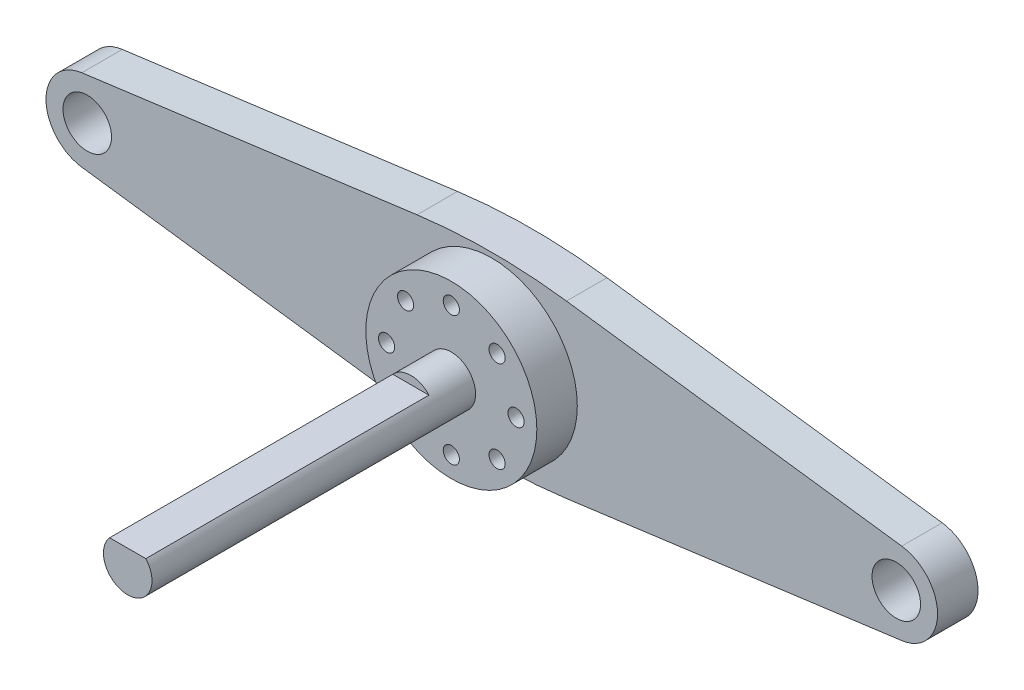
ISO-10303-21;
HEADER;
FILE_DESCRIPTION(('STEP AP214'),'2;1');
FILE_NAME('part.step','',(''),(''),'','','');
FILE_SCHEMA(('AUTOMOTIVE_DESIGN { 1 0 10303 214 1 1 1 1 }'));
ENDSEC;
DATA;
#1=APPLICATION_CONTEXT('core data for automotive mechanical design processes');
#2=APPLICATION_PROTOCOL_DEFINITION('international standard','automotive_design',2000,#1);
#3=PRODUCT_CONTEXT('',#1,'mechanical');
#4=PRODUCT('Part','Part','',(#3));
#5=PRODUCT_RELATED_PRODUCT_CATEGORY('part','',(#4));
#6=PRODUCT_DEFINITION_FORMATION('','',#4);
#7=PRODUCT_DEFINITION_CONTEXT('part definition',#1,'design');
#8=PRODUCT_DEFINITION('design','',#6,#7);
#9=PRODUCT_DEFINITION_SHAPE('','',#8);
#10=(LENGTH_UNIT() NAMED_UNIT(*) SI_UNIT(.MILLI.,.METRE.));
#11=(NAMED_UNIT(*) PLANE_ANGLE_UNIT() SI_UNIT($,.RADIAN.));
#12=(NAMED_UNIT(*) SI_UNIT($,.STERADIAN.) SOLID_ANGLE_UNIT());
#13=UNCERTAINTY_MEASURE_WITH_UNIT(LENGTH_MEASURE(1.E-05),#10,'distance_accuracy_value','');
#14=(GEOMETRIC_REPRESENTATION_CONTEXT(3) GLOBAL_UNCERTAINTY_ASSIGNED_CONTEXT((#13)) GLOBAL_UNIT_ASSIGNED_CONTEXT((#10,
#11,#12)) REPRESENTATION_CONTEXT('',''));
#15=CARTESIAN_POINT('',(0.,0.,0.));
#16=DIRECTION('',(0.,0.,1.));
#17=DIRECTION('',(1.,0.,0.));
#18=AXIS2_PLACEMENT_3D('',#15,#16,#17);
#19=CARTESIAN_POINT('',(-5.65685424949245,-5.65685424949231,5.));
#20=DIRECTION('',(0.,0.,-1.));
#21=DIRECTION('',(-1.,0.,0.));
#22=AXIS2_PLACEMENT_3D('',#19,#20,#21);
#23=CYLINDRICAL_SURFACE('',#22,1.);
#24=CARTESIAN_POINT('',(-5.65685424949245,-5.65685424949231,0.));
#25=DIRECTION('',(0.,0.,1.));
#26=DIRECTION('',(1.,0.,0.));
#27=AXIS2_PLACEMENT_3D('',#24,#25,#26);
#28=CIRCLE('',#27,1.);
#29=CARTESIAN_POINT('',(-4.65685424949245,-5.65685424949231,0.));
#30=VERTEX_POINT('',#29);
#31=EDGE_CURVE('E218',#30,#30,#28,.T.);
#32=ORIENTED_EDGE('',*,*,#31,.F.);
#33=EDGE_LOOP('',(#32));
#34=FACE_BOUND('',#33,.T.);
#35=CARTESIAN_POINT('',(-5.65685424949245,-5.65685424949231,10.));
#36=DIRECTION('',(0.,0.,1.));
#37=DIRECTION('',(1.,0.,0.));
#38=AXIS2_PLACEMENT_3D('',#35,#36,#37);
#39=CIRCLE('',#38,1.);
#40=CARTESIAN_POINT('',(-4.65685424949245,-5.65685424949231,10.));
#41=VERTEX_POINT('',#40);
#42=EDGE_CURVE('E261',#41,#41,#39,.T.);
#43=ORIENTED_EDGE('',*,*,#42,.T.);
#44=EDGE_LOOP('',(#43));
#45=FACE_BOUND('',#44,.T.);
#46=ADVANCED_FACE('F64',(#34,#45),#23,.F.);
#47=CARTESIAN_POINT('',(0.,-8.,5.));
#48=DIRECTION('',(0.,0.,-1.));
#49=DIRECTION('',(-1.,0.,0.));
#50=AXIS2_PLACEMENT_3D('',#47,#48,#49);
#51=CYLINDRICAL_SURFACE('',#50,1.);
#52=CARTESIAN_POINT('',(0.,-8.,0.));
#53=DIRECTION('',(0.,0.,1.));
#54=DIRECTION('',(1.,0.,0.));
#55=AXIS2_PLACEMENT_3D('',#52,#53,#54);
#56=CIRCLE('',#55,1.);
#57=CARTESIAN_POINT('',(0.999999999999915,-8.,0.));
#58=VERTEX_POINT('',#57);
#59=EDGE_CURVE('E215',#58,#58,#56,.T.);
#60=ORIENTED_EDGE('',*,*,#59,.F.);
#61=EDGE_LOOP('',(#60));
#62=FACE_BOUND('',#61,.T.);
#63=CARTESIAN_POINT('',(0.,-8.,10.));
#64=DIRECTION('',(0.,0.,1.));
#65=DIRECTION('',(1.,0.,0.));
#66=AXIS2_PLACEMENT_3D('',#63,#64,#65);
#67=CIRCLE('',#66,1.);
#68=CARTESIAN_POINT('',(0.999999999999915,-8.,10.));
#69=VERTEX_POINT('',#68);
#70=EDGE_CURVE('E264',#69,#69,#67,.T.);
#71=ORIENTED_EDGE('',*,*,#70,.T.);
#72=EDGE_LOOP('',(#71));
#73=FACE_BOUND('',#72,.T.);
#74=ADVANCED_FACE('F325',(#62,#73),#51,.F.);
#75=CARTESIAN_POINT('',(5.65685424949233,-5.65685424949243,5.));
#76=DIRECTION('',(0.,0.,-1.));
#77=DIRECTION('',(-1.,0.,0.));
#78=AXIS2_PLACEMENT_3D('',#75,#76,#77);
#79=CYLINDRICAL_SURFACE('',#78,1.);
#80=CARTESIAN_POINT('',(5.65685424949233,-5.65685424949243,0.));
#81=DIRECTION('',(0.,0.,1.));
#82=DIRECTION('',(1.,0.,0.));
#83=AXIS2_PLACEMENT_3D('',#80,#81,#82);
#84=CIRCLE('',#83,1.);
#85=CARTESIAN_POINT('',(6.65685424949233,-5.65685424949243,0.));
#86=VERTEX_POINT('',#85);
#87=EDGE_CURVE('E212',#86,#86,#84,.T.);
#88=ORIENTED_EDGE('',*,*,#87,.F.);
#89=EDGE_LOOP('',(#88));
#90=FACE_BOUND('',#89,.T.);
#91=CARTESIAN_POINT('',(5.65685424949233,-5.65685424949243,10.));
#92=DIRECTION('',(0.,0.,1.));
#93=DIRECTION('',(1.,0.,0.));
#94=AXIS2_PLACEMENT_3D('',#91,#92,#93);
#95=CIRCLE('',#94,1.);
#96=CARTESIAN_POINT('',(6.65685424949233,-5.65685424949243,10.));
#97=VERTEX_POINT('',#96);
#98=EDGE_CURVE('E267',#97,#97,#95,.T.);
#99=ORIENTED_EDGE('',*,*,#98,.T.);
#100=EDGE_LOOP('',(#99));
#101=FACE_BOUND('',#100,.T.);
#102=ADVANCED_FACE('F331',(#90,#101),#79,.F.);
#103=CARTESIAN_POINT('',(8.,0.,5.));
#104=DIRECTION('',(0.,0.,-1.));
#105=DIRECTION('',(-1.,0.,0.));
#106=AXIS2_PLACEMENT_3D('',#103,#104,#105);
#107=CYLINDRICAL_SURFACE('',#106,0.999999999999999);
#108=CARTESIAN_POINT('',(8.,0.,0.));
#109=DIRECTION('',(0.,0.,1.));
#110=DIRECTION('',(1.,0.,0.));
#111=AXIS2_PLACEMENT_3D('',#108,#109,#110);
#112=CIRCLE('',#111,0.999999999999999);
#113=CARTESIAN_POINT('',(9.,0.,0.));
#114=VERTEX_POINT('',#113);
#115=EDGE_CURVE('E209',#114,#114,#112,.T.);
#116=ORIENTED_EDGE('',*,*,#115,.F.);
#117=EDGE_LOOP('',(#116));
#118=FACE_BOUND('',#117,.T.);
#119=CARTESIAN_POINT('',(8.,0.,10.));
#120=DIRECTION('',(0.,0.,1.));
#121=DIRECTION('',(1.,0.,0.));
#122=AXIS2_PLACEMENT_3D('',#119,#120,#121);
#123=CIRCLE('',#122,0.999999999999999);
#124=CARTESIAN_POINT('',(9.,0.,10.));
#125=VERTEX_POINT('',#124);
#126=EDGE_CURVE('E270',#125,#125,#123,.T.);
#127=ORIENTED_EDGE('',*,*,#126,.T.);
#128=EDGE_LOOP('',(#127));
#129=FACE_BOUND('',#128,.T.);
#130=ADVANCED_FACE('F341',(#118,#129),#107,.F.);
#131=CARTESIAN_POINT('',(5.65685424949241,5.65685424949235,5.));
#132=DIRECTION('',(0.,0.,-1.));
#133=DIRECTION('',(-1.,0.,0.));
#134=AXIS2_PLACEMENT_3D('',#131,#132,#133);
#135=CYLINDRICAL_SURFACE('',#134,0.999999999999999);
#136=CARTESIAN_POINT('',(5.65685424949241,5.65685424949235,0.));
#137=DIRECTION('',(0.,0.,1.));
#138=DIRECTION('',(1.,0.,0.));
#139=AXIS2_PLACEMENT_3D('',#136,#137,#138);
#140=CIRCLE('',#139,0.999999999999999);
#141=CARTESIAN_POINT('',(6.65685424949241,5.65685424949235,0.));
#142=VERTEX_POINT('',#141);
#143=EDGE_CURVE('E206',#142,#142,#140,.T.);
#144=ORIENTED_EDGE('',*,*,#143,.F.);
#145=EDGE_LOOP('',(#144));
#146=FACE_BOUND('',#145,.T.);
#147=CARTESIAN_POINT('',(5.65685424949241,5.65685424949235,10.));
#148=DIRECTION('',(0.,0.,1.));
#149=DIRECTION('',(1.,0.,0.));
#150=AXIS2_PLACEMENT_3D('',#147,#148,#149);
#151=CIRCLE('',#150,0.999999999999999);
#152=CARTESIAN_POINT('',(6.65685424949241,5.65685424949235,10.));
#153=VERTEX_POINT('',#152);
#154=EDGE_CURVE('E273',#153,#153,#151,.T.);
#155=ORIENTED_EDGE('',*,*,#154,.T.);
#156=EDGE_LOOP('',(#155));
#157=FACE_BOUND('',#156,.T.);
#158=ADVANCED_FACE('F345',(#146,#157),#135,.F.);
#159=CARTESIAN_POINT('',(0.,8.,5.));
#160=DIRECTION('',(0.,0.,-1.));
#161=DIRECTION('',(-1.,0.,0.));
#162=AXIS2_PLACEMENT_3D('',#159,#160,#161);
#163=CYLINDRICAL_SURFACE('',#162,1.);
#164=CARTESIAN_POINT('',(0.,8.,0.));
#165=DIRECTION('',(0.,0.,1.));
#166=DIRECTION('',(1.,0.,0.));
#167=AXIS2_PLACEMENT_3D('',#164,#165,#166);
#168=CIRCLE('',#167,1.);
#169=CARTESIAN_POINT('',(1.00000000000003,8.,0.));
#170=VERTEX_POINT('',#169);
#171=EDGE_CURVE('E203',#170,#170,#168,.T.);
#172=ORIENTED_EDGE('',*,*,#171,.F.);
#173=EDGE_LOOP('',(#172));
#174=FACE_BOUND('',#173,.T.);
#175=CARTESIAN_POINT('',(0.,8.,10.));
#176=DIRECTION('',(0.,0.,1.));
#177=DIRECTION('',(1.,0.,0.));
#178=AXIS2_PLACEMENT_3D('',#175,#176,#177);
#179=CIRCLE('',#178,1.);
#180=CARTESIAN_POINT('',(1.00000000000003,8.,10.));
#181=VERTEX_POINT('',#180);
#182=EDGE_CURVE('E276',#181,#181,#179,.T.);
#183=ORIENTED_EDGE('',*,*,#182,.T.);
#184=EDGE_LOOP('',(#183));
#185=FACE_BOUND('',#184,.T.);
#186=ADVANCED_FACE('F349',(#174,#185),#163,.F.);
#187=CARTESIAN_POINT('',(-8.,0.,5.));
#188=DIRECTION('',(0.,0.,-1.));
#189=DIRECTION('',(-1.,0.,0.));
#190=AXIS2_PLACEMENT_3D('',#187,#188,#189);
#191=CYLINDRICAL_SURFACE('',#190,1.);
#192=CARTESIAN_POINT('',(-8.,0.,0.));
#193=DIRECTION('',(0.,0.,1.));
#194=DIRECTION('',(1.,0.,0.));
#195=AXIS2_PLACEMENT_3D('',#192,#193,#194);
#196=CIRCLE('',#195,1.);
#197=CARTESIAN_POINT('',(-7.,0.,0.));
#198=VERTEX_POINT('',#197);
#199=EDGE_CURVE('E200',#198,#198,#196,.T.);
#200=ORIENTED_EDGE('',*,*,#199,.F.);
#201=EDGE_LOOP('',(#200));
#202=FACE_BOUND('',#201,.T.);
#203=CARTESIAN_POINT('',(-8.,0.,10.));
#204=DIRECTION('',(0.,0.,1.));
#205=DIRECTION('',(1.,0.,0.));
#206=AXIS2_PLACEMENT_3D('',#203,#204,#205);
#207=CIRCLE('',#206,1.);
#208=CARTESIAN_POINT('',(-7.,0.,10.));
#209=VERTEX_POINT('',#208);
#210=EDGE_CURVE('E279',#209,#209,#207,.T.);
#211=ORIENTED_EDGE('',*,*,#210,.T.);
#212=EDGE_LOOP('',(#211));
#213=FACE_BOUND('',#212,.T.);
#214=ADVANCED_FACE('F353',(#202,#213),#191,.F.);
#215=CARTESIAN_POINT('',(-5.65685424949237,5.65685424949239,5.));
#216=DIRECTION('',(0.,0.,-1.));
#217=DIRECTION('',(-1.,0.,0.));
#218=AXIS2_PLACEMENT_3D('',#215,#216,#217);
#219=CYLINDRICAL_SURFACE('',#218,0.999999999999999);
#220=CARTESIAN_POINT('',(-5.65685424949237,5.65685424949239,0.));
#221=DIRECTION('',(0.,0.,1.));
#222=DIRECTION('',(1.,0.,0.));
#223=AXIS2_PLACEMENT_3D('',#220,#221,#222);
#224=CIRCLE('',#223,0.999999999999999);
#225=CARTESIAN_POINT('',(-4.65685424949237,5.65685424949239,0.));
#226=VERTEX_POINT('',#225);
#227=EDGE_CURVE('E197',#226,#226,#224,.T.);
#228=ORIENTED_EDGE('',*,*,#227,.F.);
#229=EDGE_LOOP('',(#228));
#230=FACE_BOUND('',#229,.T.);
#231=CARTESIAN_POINT('',(-5.65685424949237,5.65685424949239,10.));
#232=DIRECTION('',(0.,0.,1.));
#233=DIRECTION('',(1.,0.,0.));
#234=AXIS2_PLACEMENT_3D('',#231,#232,#233);
#235=CIRCLE('',#234,0.999999999999999);
#236=CARTESIAN_POINT('',(-4.65685424949237,5.65685424949239,10.));
#237=VERTEX_POINT('',#236);
#238=EDGE_CURVE('E282',#237,#237,#235,.T.);
#239=ORIENTED_EDGE('',*,*,#238,.T.);
#240=EDGE_LOOP('',(#239));
#241=FACE_BOUND('',#240,.T.);
#242=ADVANCED_FACE('F357',(#230,#241),#219,.F.);
#243=CARTESIAN_POINT('',(0.,58.8173671567806,5.));
#244=DIRECTION('',(0.,0.,-1.));
#245=DIRECTION('',(-1.,0.,0.));
#246=AXIS2_PLACEMENT_3D('',#243,#244,#245);
#247=CYLINDRICAL_SURFACE('',#246,70.);
#248=CARTESIAN_POINT('',(0.,58.8173671567806,0.));
#249=DIRECTION('',(0.,0.,1.));
#250=DIRECTION('',(1.,0.,0.));
#251=AXIS2_PLACEMENT_3D('',#248,#249,#250);
#252=CIRCLE('',#251,70.);
#253=CARTESIAN_POINT('',(-9.23511167640649,-10.5707637614413,0.));
#254=VERTEX_POINT('',#253);
#255=CARTESIAN_POINT('',(9.23511167640649,-10.5707637614413,0.));
#256=VERTEX_POINT('',#255);
#257=EDGE_CURVE('E181',#254,#256,#252,.T.);
#258=ORIENTED_EDGE('',*,*,#257,.T.);
#259=DIRECTION('',(0.,0.,-1.));
#260=VECTOR('',#259,1.);
#261=CARTESIAN_POINT('',(9.23511167640649,-10.5707637614413,5.));
#262=LINE('',#261,#260);
#263=CARTESIAN_POINT('',(9.23511167640649,-10.5707637614413,5.));
#264=VERTEX_POINT('',#263);
#265=EDGE_CURVE('E73',#264,#256,#262,.T.);
#266=ORIENTED_EDGE('',*,*,#265,.F.);
#267=CARTESIAN_POINT('',(0.,58.8173671567806,5.));
#268=DIRECTION('',(0.,0.,1.));
#269=DIRECTION('',(1.,0.,0.));
#270=AXIS2_PLACEMENT_3D('',#267,#268,#269);
#271=CIRCLE('',#270,70.);
#272=CARTESIAN_POINT('',(-9.23511167640649,-10.5707637614413,5.));
#273=VERTEX_POINT('',#272);
#274=EDGE_CURVE('E129',#273,#264,#271,.T.);
#275=ORIENTED_EDGE('',*,*,#274,.F.);
#276=DIRECTION('',(0.,0.,-1.));
#277=VECTOR('',#276,1.);
#278=CARTESIAN_POINT('',(-9.23511167640649,-10.5707637614413,5.));
#279=LINE('',#278,#277);
#280=EDGE_CURVE('E12',#273,#254,#279,.T.);
#281=ORIENTED_EDGE('',*,*,#280,.T.);
#282=EDGE_LOOP('',(#258,#266,#275,#281));
#283=FACE_BOUND('',#282,.T.);
#284=ADVANCED_FACE('F235',(#283),#247,.T.);
#285=CARTESIAN_POINT('',(1.54315479575544,-11.5945134987938,5.));
#286=DIRECTION('',(0.131930166805804,-0.991259013117456,0.));
#287=DIRECTION('',(0.991259013117456,0.131930166805804,0.));
#288=AXIS2_PLACEMENT_3D('',#285,#286,#287);
#289=PLANE('',#288);
#290=DIRECTION('',(-0.991259013117456,-0.131930166805804,0.));
#291=VECTOR('',#290,1.);
#292=CARTESIAN_POINT('',(1.54315479575544,-11.5945134987938,0.));
#293=LINE('',#292,#291);
#294=CARTESIAN_POINT('',(50.6728763500851,-5.05566515137672,0.));
#295=VERTEX_POINT('',#294);
#296=EDGE_CURVE('E184',#295,#256,#293,.T.);
#297=ORIENTED_EDGE('',*,*,#296,.F.);
#298=DIRECTION('',(0.,0.,-1.));
#299=VECTOR('',#298,1.);
#300=CARTESIAN_POINT('',(50.6728763500851,-5.05566515137672,5.));
#301=LINE('',#300,#299);
#302=CARTESIAN_POINT('',(50.6728763500851,-5.05566515137672,5.));
#303=VERTEX_POINT('',#302);
#304=EDGE_CURVE('E227',#303,#295,#301,.T.);
#305=ORIENTED_EDGE('',*,*,#304,.F.);
#306=DIRECTION('',(-0.991259013117456,-0.131930166805804,0.));
#307=VECTOR('',#306,1.);
#308=CARTESIAN_POINT('',(1.54315479575544,-11.5945134987938,5.));
#309=LINE('',#308,#307);
#310=EDGE_CURVE('E234',#303,#264,#309,.T.);
#311=ORIENTED_EDGE('',*,*,#310,.T.);
#312=ORIENTED_EDGE('',*,*,#265,.T.);
#313=EDGE_LOOP('',(#297,#305,#311,#312));
#314=FACE_BOUND('',#313,.T.);
#315=ADVANCED_FACE('F232',(#314),#289,.T.);
#316=CARTESIAN_POINT('',(50.,0.,5.));
#317=DIRECTION('',(0.,0.,-1.));
#318=DIRECTION('',(-1.,0.,0.));
#319=AXIS2_PLACEMENT_3D('',#316,#317,#318);
#320=CYLINDRICAL_SURFACE('',#319,5.10024633771241);
#321=CARTESIAN_POINT('',(50.,0.,0.));
#322=DIRECTION('',(0.,0.,1.));
#323=DIRECTION('',(1.,0.,0.));
#324=AXIS2_PLACEMENT_3D('',#321,#322,#323);
#325=CIRCLE('',#324,5.10024633771241);
#326=CARTESIAN_POINT('',(50.6728763500851,5.05566515137672,0.));
#327=VERTEX_POINT('',#326);
#328=EDGE_CURVE('E187',#327,#295,#325,.F.);
#329=ORIENTED_EDGE('',*,*,#328,.F.);
#330=DIRECTION('',(0.,0.,-1.));
#331=VECTOR('',#330,1.);
#332=CARTESIAN_POINT('',(50.6728763500851,5.05566515137672,5.));
#333=LINE('',#332,#331);
#334=CARTESIAN_POINT('',(50.6728763500851,5.05566515137672,5.));
#335=VERTEX_POINT('',#334);
#336=EDGE_CURVE('E225',#335,#327,#333,.T.);
#337=ORIENTED_EDGE('',*,*,#336,.F.);
#338=CARTESIAN_POINT('',(50.,0.,5.));
#339=DIRECTION('',(0.,0.,1.));
#340=DIRECTION('',(1.,0.,0.));
#341=AXIS2_PLACEMENT_3D('',#338,#339,#340);
#342=CIRCLE('',#341,5.10024633771241);
#343=EDGE_CURVE('E246',#335,#303,#342,.F.);
#344=ORIENTED_EDGE('',*,*,#343,.T.);
#345=ORIENTED_EDGE('',*,*,#304,.T.);
#346=EDGE_LOOP('',(#329,#337,#344,#345));
#347=FACE_BOUND('',#346,.T.);
#348=ADVANCED_FACE('F244',(#347),#320,.T.);
#349=CARTESIAN_POINT('',(1.54315479575544,11.5945134987938,5.));
#350=DIRECTION('',(-0.131930166805804,-0.991259013117456,0.));
#351=DIRECTION('',(0.991259013117456,-0.131930166805804,0.));
#352=AXIS2_PLACEMENT_3D('',#349,#350,#351);
#353=PLANE('',#352);
#354=DIRECTION('',(-0.991259013117456,0.131930166805804,0.));
#355=VECTOR('',#354,1.);
#356=CARTESIAN_POINT('',(1.54315479575544,11.5945134987938,0.));
#357=LINE('',#356,#355);
#358=CARTESIAN_POINT('',(9.23511167640649,10.5707637614413,0.));
#359=VERTEX_POINT('',#358);
#360=EDGE_CURVE('E190',#327,#359,#357,.T.);
#361=ORIENTED_EDGE('',*,*,#360,.T.);
#362=DIRECTION('',(0.,0.,-1.));
#363=VECTOR('',#362,1.);
#364=CARTESIAN_POINT('',(9.23511167640649,10.5707637614413,5.));
#365=LINE('',#364,#363);
#366=CARTESIAN_POINT('',(9.23511167640649,10.5707637614413,5.));
#367=VERTEX_POINT('',#366);
#368=EDGE_CURVE('E156',#367,#359,#365,.T.);
#369=ORIENTED_EDGE('',*,*,#368,.F.);
#370=DIRECTION('',(-0.991259013117456,0.131930166805804,0.));
#371=VECTOR('',#370,1.);
#372=CARTESIAN_POINT('',(1.54315479575544,11.5945134987938,5.));
#373=LINE('',#372,#371);
#374=EDGE_CURVE('E163',#335,#367,#373,.T.);
#375=ORIENTED_EDGE('',*,*,#374,.F.);
#376=ORIENTED_EDGE('',*,*,#336,.T.);
#377=EDGE_LOOP('',(#361,#369,#375,#376));
#378=FACE_BOUND('',#377,.T.);
#379=ADVANCED_FACE('F370',(#378),#353,.F.);
#380=CARTESIAN_POINT('',(0.,-58.8173671567806,5.));
#381=DIRECTION('',(0.,0.,-1.));
#382=DIRECTION('',(-1.,0.,0.));
#383=AXIS2_PLACEMENT_3D('',#380,#381,#382);
#384=CYLINDRICAL_SURFACE('',#383,70.);
#385=CARTESIAN_POINT('',(0.,-58.8173671567806,0.));
#386=DIRECTION('',(0.,0.,1.));
#387=DIRECTION('',(1.,0.,0.));
#388=AXIS2_PLACEMENT_3D('',#385,#386,#387);
#389=CIRCLE('',#388,70.);
#390=CARTESIAN_POINT('',(-9.23511167640649,10.5707637614413,0.));
#391=VERTEX_POINT('',#390);
#392=EDGE_CURVE('E151',#391,#359,#389,.F.);
#393=ORIENTED_EDGE('',*,*,#392,.F.);
#394=DIRECTION('',(0.,0.,-1.));
#395=VECTOR('',#394,1.);
#396=CARTESIAN_POINT('',(-9.23511167640649,10.5707637614413,5.));
#397=LINE('',#396,#395);
#398=CARTESIAN_POINT('',(-9.23511167640649,10.5707637614413,5.));
#399=VERTEX_POINT('',#398);
#400=EDGE_CURVE('E146',#399,#391,#397,.T.);
#401=ORIENTED_EDGE('',*,*,#400,.F.);
#402=CARTESIAN_POINT('',(0.,-58.8173671567806,5.));
#403=DIRECTION('',(0.,0.,1.));
#404=DIRECTION('',(1.,0.,0.));
#405=AXIS2_PLACEMENT_3D('',#402,#403,#404);
#406=CIRCLE('',#405,70.);
#407=EDGE_CURVE('E149',#399,#367,#406,.F.);
#408=ORIENTED_EDGE('',*,*,#407,.T.);
#409=ORIENTED_EDGE('',*,*,#368,.T.);
#410=EDGE_LOOP('',(#393,#401,#408,#409));
#411=FACE_BOUND('',#410,.T.);
#412=ADVANCED_FACE('F148',(#411),#384,.T.);
#413=CARTESIAN_POINT('',(-1.54315479575544,11.5945134987938,5.));
#414=DIRECTION('',(-0.131930166805804,0.991259013117456,0.));
#415=DIRECTION('',(-0.991259013117456,-0.131930166805804,0.));
#416=AXIS2_PLACEMENT_3D('',#413,#414,#415);
#417=PLANE('',#416);
#418=DIRECTION('',(0.991259013117456,0.131930166805804,0.));
#419=VECTOR('',#418,1.);
#420=CARTESIAN_POINT('',(-1.54315479575544,11.5945134987938,0.));
#421=LINE('',#420,#419);
#422=CARTESIAN_POINT('',(-50.6728763500851,5.05566515137672,0.));
#423=VERTEX_POINT('',#422);
#424=EDGE_CURVE('E194',#423,#391,#421,.T.);
#425=ORIENTED_EDGE('',*,*,#424,.F.);
#426=DIRECTION('',(0.,0.,-1.));
#427=VECTOR('',#426,1.);
#428=CARTESIAN_POINT('',(-50.6728763500851,5.05566515137672,5.));
#429=LINE('',#428,#427);
#430=CARTESIAN_POINT('',(-50.6728763500851,5.05566515137672,5.));
#431=VERTEX_POINT('',#430);
#432=EDGE_CURVE('E157',#431,#423,#429,.T.);
#433=ORIENTED_EDGE('',*,*,#432,.F.);
#434=DIRECTION('',(0.991259013117456,0.131930166805804,0.));
#435=VECTOR('',#434,1.);
#436=CARTESIAN_POINT('',(-1.54315479575544,11.5945134987938,5.));
#437=LINE('',#436,#435);
#438=EDGE_CURVE('E160',#431,#399,#437,.T.);
#439=ORIENTED_EDGE('',*,*,#438,.T.);
#440=ORIENTED_EDGE('',*,*,#400,.T.);
#441=EDGE_LOOP('',(#425,#433,#439,#440));
#442=FACE_BOUND('',#441,.T.);
#443=ADVANCED_FACE('F166',(#442),#417,.T.);
#444=CARTESIAN_POINT('',(-50.,0.,5.));
#445=DIRECTION('',(0.,0.,-1.));
#446=DIRECTION('',(-1.,0.,0.));
#447=AXIS2_PLACEMENT_3D('',#444,#445,#446);
#448=CYLINDRICAL_SURFACE('',#447,5.10024633771241);
#449=CARTESIAN_POINT('',(-50.,0.,0.));
#450=DIRECTION('',(0.,0.,1.));
#451=DIRECTION('',(1.,0.,0.));
#452=AXIS2_PLACEMENT_3D('',#449,#450,#451);
#453=CIRCLE('',#452,5.10024633771241);
#454=CARTESIAN_POINT('',(-50.6728763500851,-5.05566515137672,0.));
#455=VERTEX_POINT('',#454);
#456=EDGE_CURVE('E121',#423,#455,#453,.T.);
#457=ORIENTED_EDGE('',*,*,#456,.T.);
#458=DIRECTION('',(0.,0.,-1.));
#459=VECTOR('',#458,1.);
#460=CARTESIAN_POINT('',(-50.6728763500851,-5.05566515137672,5.));
#461=LINE('',#460,#459);
#462=CARTESIAN_POINT('',(-50.6728763500851,-5.05566515137672,5.));
#463=VERTEX_POINT('',#462);
#464=EDGE_CURVE('E168',#463,#455,#461,.T.);
#465=ORIENTED_EDGE('',*,*,#464,.F.);
#466=CARTESIAN_POINT('',(-50.,0.,5.));
#467=DIRECTION('',(0.,0.,1.));
#468=DIRECTION('',(1.,0.,0.));
#469=AXIS2_PLACEMENT_3D('',#466,#467,#468);
#470=CIRCLE('',#469,5.10024633771241);
#471=EDGE_CURVE('E88',#431,#463,#470,.T.);
#472=ORIENTED_EDGE('',*,*,#471,.F.);
#473=ORIENTED_EDGE('',*,*,#432,.T.);
#474=EDGE_LOOP('',(#457,#465,#472,#473));
#475=FACE_BOUND('',#474,.T.);
#476=ADVANCED_FACE('F362',(#475),#448,.T.);
#477=CARTESIAN_POINT('',(-1.54315479575544,-11.5945134987938,5.));
#478=DIRECTION('',(0.131930166805804,0.991259013117456,0.));
#479=DIRECTION('',(-0.991259013117456,0.131930166805804,0.));
#480=AXIS2_PLACEMENT_3D('',#477,#478,#479);
#481=PLANE('',#480);
#482=DIRECTION('',(0.991259013117456,-0.131930166805804,0.));
#483=VECTOR('',#482,1.);
#484=CARTESIAN_POINT('',(-1.54315479575544,-11.5945134987938,0.));
#485=LINE('',#484,#483);
#486=EDGE_CURVE('E178',#455,#254,#485,.T.);
#487=ORIENTED_EDGE('',*,*,#486,.T.);
#488=ORIENTED_EDGE('',*,*,#280,.F.);
#489=DIRECTION('',(0.991259013117456,-0.131930166805804,0.));
#490=VECTOR('',#489,1.);
#491=CARTESIAN_POINT('',(-1.54315479575544,-11.5945134987938,5.));
#492=LINE('',#491,#490);
#493=EDGE_CURVE('E249',#463,#273,#492,.T.);
#494=ORIENTED_EDGE('',*,*,#493,.F.);
#495=ORIENTED_EDGE('',*,*,#464,.T.);
#496=EDGE_LOOP('',(#487,#488,#494,#495));
#497=FACE_BOUND('',#496,.T.);
#498=ADVANCED_FACE('F365',(#497),#481,.F.);
#499=CARTESIAN_POINT('',(-50.,0.,5.));
#500=DIRECTION('',(0.,0.,-1.));
#501=DIRECTION('',(-1.,0.,0.));
#502=AXIS2_PLACEMENT_3D('',#499,#500,#501);
#503=CYLINDRICAL_SURFACE('',#502,3.);
#504=CARTESIAN_POINT('',(-50.,0.,5.));
#505=DIRECTION('',(0.,0.,1.));
#506=DIRECTION('',(1.,0.,0.));
#507=AXIS2_PLACEMENT_3D('',#504,#505,#506);
#508=CIRCLE('',#507,3.);
#509=CARTESIAN_POINT('',(-47.,0.,5.));
#510=VERTEX_POINT('',#509);
#511=EDGE_CURVE('E253',#510,#510,#508,.T.);
#512=ORIENTED_EDGE('',*,*,#511,.T.);
#513=EDGE_LOOP('',(#512));
#514=FACE_BOUND('',#513,.T.);
#515=CARTESIAN_POINT('',(-50.,0.,0.));
#516=DIRECTION('',(0.,0.,1.));
#517=DIRECTION('',(1.,0.,0.));
#518=AXIS2_PLACEMENT_3D('',#515,#516,#517);
#519=CIRCLE('',#518,3.);
#520=CARTESIAN_POINT('',(-47.,0.,0.));
#521=VERTEX_POINT('',#520);
#522=EDGE_CURVE('E175',#521,#521,#519,.T.);
#523=ORIENTED_EDGE('',*,*,#522,.F.);
#524=EDGE_LOOP('',(#523));
#525=FACE_BOUND('',#524,.T.);
#526=ADVANCED_FACE('F381',(#514,#525),#503,.F.);
#527=CARTESIAN_POINT('',(50.,0.,5.));
#528=DIRECTION('',(0.,0.,-1.));
#529=DIRECTION('',(-1.,0.,0.));
#530=AXIS2_PLACEMENT_3D('',#527,#528,#529);
#531=CYLINDRICAL_SURFACE('',#530,3.);
#532=CARTESIAN_POINT('',(50.,0.,5.));
#533=DIRECTION('',(0.,0.,1.));
#534=DIRECTION('',(1.,0.,0.));
#535=AXIS2_PLACEMENT_3D('',#532,#533,#534);
#536=CIRCLE('',#535,3.);
#537=CARTESIAN_POINT('',(53.,0.,5.));
#538=VERTEX_POINT('',#537);
#539=EDGE_CURVE('E221',#538,#538,#536,.F.);
#540=ORIENTED_EDGE('',*,*,#539,.F.);
#541=EDGE_LOOP('',(#540));
#542=FACE_BOUND('',#541,.T.);
#543=CARTESIAN_POINT('',(50.,0.,0.));
#544=DIRECTION('',(0.,0.,1.));
#545=DIRECTION('',(1.,0.,0.));
#546=AXIS2_PLACEMENT_3D('',#543,#544,#545);
#547=CIRCLE('',#546,3.);
#548=CARTESIAN_POINT('',(53.,0.,0.));
#549=VERTEX_POINT('',#548);
#550=EDGE_CURVE('E172',#549,#549,#547,.F.);
#551=ORIENTED_EDGE('',*,*,#550,.T.);
#552=EDGE_LOOP('',(#551));
#553=FACE_BOUND('',#552,.T.);
#554=ADVANCED_FACE('F66',(#542,#553),#531,.F.);
#555=CARTESIAN_POINT('',(0.,0.,0.));
#556=DIRECTION('',(0.,0.,1.));
#557=DIRECTION('',(1.,0.,0.));
#558=AXIS2_PLACEMENT_3D('',#555,#556,#557);
#559=PLANE('',#558);
#560=ORIENTED_EDGE('',*,*,#550,.F.);
#561=EDGE_LOOP('',(#560));
#562=FACE_BOUND('',#561,.T.);
#563=ORIENTED_EDGE('',*,*,#522,.T.);
#564=EDGE_LOOP('',(#563));
#565=FACE_BOUND('',#564,.T.);
#566=ORIENTED_EDGE('',*,*,#486,.F.);
#567=ORIENTED_EDGE('',*,*,#456,.F.);
#568=ORIENTED_EDGE('',*,*,#424,.T.);
#569=ORIENTED_EDGE('',*,*,#392,.T.);
#570=ORIENTED_EDGE('',*,*,#360,.F.);
#571=ORIENTED_EDGE('',*,*,#328,.T.);
#572=ORIENTED_EDGE('',*,*,#296,.T.);
#573=ORIENTED_EDGE('',*,*,#257,.F.);
#574=EDGE_LOOP('',(#566,#567,#568,#569,#570,#571,#572,#573));
#575=FACE_BOUND('',#574,.T.);
#576=ORIENTED_EDGE('',*,*,#31,.T.);
#577=EDGE_LOOP('',(#576));
#578=FACE_BOUND('',#577,.T.);
#579=ORIENTED_EDGE('',*,*,#59,.T.);
#580=EDGE_LOOP('',(#579));
#581=FACE_BOUND('',#580,.T.);
#582=ORIENTED_EDGE('',*,*,#87,.T.);
#583=EDGE_LOOP('',(#582));
#584=FACE_BOUND('',#583,.T.);
#585=ORIENTED_EDGE('',*,*,#115,.T.);
#586=EDGE_LOOP('',(#585));
#587=FACE_BOUND('',#586,.T.);
#588=ORIENTED_EDGE('',*,*,#143,.T.);
#589=EDGE_LOOP('',(#588));
#590=FACE_BOUND('',#589,.T.);
#591=ORIENTED_EDGE('',*,*,#171,.T.);
#592=EDGE_LOOP('',(#591));
#593=FACE_BOUND('',#592,.T.);
#594=ORIENTED_EDGE('',*,*,#199,.T.);
#595=EDGE_LOOP('',(#594));
#596=FACE_BOUND('',#595,.T.);
#597=ORIENTED_EDGE('',*,*,#227,.T.);
#598=EDGE_LOOP('',(#597));
#599=FACE_BOUND('',#598,.T.);
#600=ADVANCED_FACE('F239',(#562,#565,#575,#578,#581,#584,#587,#590,#593,#596,#599),#559,.F.);
#601=CARTESIAN_POINT('',(0.,0.,5.));
#602=DIRECTION('',(0.,0.,1.));
#603=DIRECTION('',(1.,0.,0.));
#604=AXIS2_PLACEMENT_3D('',#601,#602,#603);
#605=PLANE('',#604);
#606=CARTESIAN_POINT('',(0.,0.,5.));
#607=DIRECTION('',(0.,0.,1.));
#608=DIRECTION('',(1.,0.,0.));
#609=AXIS2_PLACEMENT_3D('',#606,#607,#608);
#610=CIRCLE('',#609,10.5707637614413);
#611=CARTESIAN_POINT('',(10.5707637614413,0.,5.));
#612=VERTEX_POINT('',#611);
#613=EDGE_CURVE('E68',#612,#612,#610,.F.);
#614=ORIENTED_EDGE('',*,*,#613,.T.);
#615=EDGE_LOOP('',(#614));
#616=FACE_BOUND('',#615,.T.);
#617=ORIENTED_EDGE('',*,*,#539,.T.);
#618=EDGE_LOOP('',(#617));
#619=FACE_BOUND('',#618,.T.);
#620=ORIENTED_EDGE('',*,*,#511,.F.);
#621=EDGE_LOOP('',(#620));
#622=FACE_BOUND('',#621,.T.);
#623=ORIENTED_EDGE('',*,*,#493,.T.);
#624=ORIENTED_EDGE('',*,*,#274,.T.);
#625=ORIENTED_EDGE('',*,*,#310,.F.);
#626=ORIENTED_EDGE('',*,*,#343,.F.);
#627=ORIENTED_EDGE('',*,*,#374,.T.);
#628=ORIENTED_EDGE('',*,*,#407,.F.);
#629=ORIENTED_EDGE('',*,*,#438,.F.);
#630=ORIENTED_EDGE('',*,*,#471,.T.);
#631=EDGE_LOOP('',(#623,#624,#625,#626,#627,#628,#629,#630));
#632=FACE_BOUND('',#631,.T.);
#633=ADVANCED_FACE('F159',(#616,#619,#622,#632),#605,.T.);
#634=CARTESIAN_POINT('',(0.,0.,10.));
#635=DIRECTION('',(0.,0.,-1.));
#636=DIRECTION('',(-1.,0.,0.));
#637=AXIS2_PLACEMENT_3D('',#634,#635,#636);
#638=CYLINDRICAL_SURFACE('',#637,10.5707637614413);
#639=ORIENTED_EDGE('',*,*,#613,.F.);
#640=EDGE_LOOP('',(#639));
#641=FACE_BOUND('',#640,.T.);
#642=CARTESIAN_POINT('',(0.,0.,10.));
#643=DIRECTION('',(0.,0.,1.));
#644=DIRECTION('',(1.,0.,0.));
#645=AXIS2_PLACEMENT_3D('',#642,#643,#644);
#646=CIRCLE('',#645,10.5707637614413);
#647=CARTESIAN_POINT('',(10.5707637614413,0.,10.));
#648=VERTEX_POINT('',#647);
#649=EDGE_CURVE('E258',#648,#648,#646,.T.);
#650=ORIENTED_EDGE('',*,*,#649,.F.);
#651=EDGE_LOOP('',(#650));
#652=FACE_BOUND('',#651,.T.);
#653=ADVANCED_FACE('F398',(#641,#652),#638,.T.);
#654=CARTESIAN_POINT('',(0.,0.,10.));
#655=DIRECTION('',(0.,0.,1.));
#656=DIRECTION('',(1.,0.,0.));
#657=AXIS2_PLACEMENT_3D('',#654,#655,#656);
#658=PLANE('',#657);
#659=CARTESIAN_POINT('',(0.,0.,10.));
#660=DIRECTION('',(0.,0.,1.));
#661=DIRECTION('',(1.,0.,0.));
#662=AXIS2_PLACEMENT_3D('',#659,#660,#661);
#663=CIRCLE('',#662,3.);
#664=CARTESIAN_POINT('',(3.,0.,10.));
#665=VERTEX_POINT('',#664);
#666=EDGE_CURVE('E285',#665,#665,#663,.T.);
#667=ORIENTED_EDGE('',*,*,#666,.F.);
#668=EDGE_LOOP('',(#667));
#669=FACE_BOUND('',#668,.T.);
#670=ORIENTED_EDGE('',*,*,#238,.F.);
#671=EDGE_LOOP('',(#670));
#672=FACE_BOUND('',#671,.T.);
#673=ORIENTED_EDGE('',*,*,#210,.F.);
#674=EDGE_LOOP('',(#673));
#675=FACE_BOUND('',#674,.T.);
#676=ORIENTED_EDGE('',*,*,#182,.F.);
#677=EDGE_LOOP('',(#676));
#678=FACE_BOUND('',#677,.T.);
#679=ORIENTED_EDGE('',*,*,#154,.F.);
#680=EDGE_LOOP('',(#679));
#681=FACE_BOUND('',#680,.T.);
#682=ORIENTED_EDGE('',*,*,#126,.F.);
#683=EDGE_LOOP('',(#682));
#684=FACE_BOUND('',#683,.T.);
#685=ORIENTED_EDGE('',*,*,#98,.F.);
#686=EDGE_LOOP('',(#685));
#687=FACE_BOUND('',#686,.T.);
#688=ORIENTED_EDGE('',*,*,#70,.F.);
#689=EDGE_LOOP('',(#688));
#690=FACE_BOUND('',#689,.T.);
#691=ORIENTED_EDGE('',*,*,#42,.F.);
#692=EDGE_LOOP('',(#691));
#693=FACE_BOUND('',#692,.T.);
#694=ORIENTED_EDGE('',*,*,#649,.T.);
#695=EDGE_LOOP('',(#694));
#696=FACE_BOUND('',#695,.T.);
#697=ADVANCED_FACE('F405',(#669,#672,#675,#678,#681,#684,#687,#690,#693,#696),#658,.T.);
#698=CARTESIAN_POINT('',(0.,2.,50.));
#699=DIRECTION('',(0.,-1.,0.));
#700=DIRECTION('',(1.,0.,0.));
#701=AXIS2_PLACEMENT_3D('',#698,#699,#700);
#702=PLANE('',#701);
#703=DIRECTION('',(0.,0.,-1.));
#704=VECTOR('',#703,1.);
#705=CARTESIAN_POINT('',(2.23606797749979,2.,50.));
#706=LINE('',#705,#704);
#707=CARTESIAN_POINT('',(2.23606797749979,2.,50.));
#708=VERTEX_POINT('',#707);
#709=CARTESIAN_POINT('',(2.23606797749979,2.,15.));
#710=VERTEX_POINT('',#709);
#711=EDGE_CURVE('E291',#708,#710,#706,.T.);
#712=ORIENTED_EDGE('',*,*,#711,.T.);
#713=DIRECTION('',(-1.,0.,0.));
#714=VECTOR('',#713,1.);
#715=CARTESIAN_POINT('',(0.,2.,15.));
#716=LINE('',#715,#714);
#717=CARTESIAN_POINT('',(-2.23606797749979,2.,15.));
#718=VERTEX_POINT('',#717);
#719=EDGE_CURVE('E300',#710,#718,#716,.T.);
#720=ORIENTED_EDGE('',*,*,#719,.T.);
#721=DIRECTION('',(0.,0.,-1.));
#722=VECTOR('',#721,1.);
#723=CARTESIAN_POINT('',(-2.23606797749979,2.,50.));
#724=LINE('',#723,#722);
#725=CARTESIAN_POINT('',(-2.23606797749979,2.,50.));
#726=VERTEX_POINT('',#725);
#727=EDGE_CURVE('E288',#726,#718,#724,.T.);
#728=ORIENTED_EDGE('',*,*,#727,.F.);
#729=DIRECTION('',(-1.,0.,0.));
#730=VECTOR('',#729,1.);
#731=CARTESIAN_POINT('',(0.,2.,50.));
#732=LINE('',#731,#730);
#733=EDGE_CURVE('E297',#708,#726,#732,.T.);
#734=ORIENTED_EDGE('',*,*,#733,.F.);
#735=EDGE_LOOP('',(#712,#720,#728,#734));
#736=FACE_BOUND('',#735,.T.);
#737=ADVANCED_FACE('F304',(#736),#702,.F.);
#738=CARTESIAN_POINT('',(0.,0.,50.));
#739=DIRECTION('',(0.,0.,-1.));
#740=DIRECTION('',(-1.,0.,0.));
#741=AXIS2_PLACEMENT_3D('',#738,#739,#740);
#742=CYLINDRICAL_SURFACE('',#741,3.);
#743=ORIENTED_EDGE('',*,*,#666,.T.);
#744=EDGE_LOOP('',(#743));
#745=FACE_BOUND('',#744,.T.);
#746=ORIENTED_EDGE('',*,*,#727,.T.);
#747=CARTESIAN_POINT('',(0.,0.,15.));
#748=DIRECTION('',(0.,0.,1.));
#749=DIRECTION('',(1.,0.,0.));
#750=AXIS2_PLACEMENT_3D('',#747,#748,#749);
#751=CIRCLE('',#750,3.);
#752=EDGE_CURVE('E79',#710,#718,#751,.T.);
#753=ORIENTED_EDGE('',*,*,#752,.F.);
#754=ORIENTED_EDGE('',*,*,#711,.F.);
#755=CARTESIAN_POINT('',(0.,0.,50.));
#756=DIRECTION('',(0.,0.,1.));
#757=DIRECTION('',(1.,0.,0.));
#758=AXIS2_PLACEMENT_3D('',#755,#756,#757);
#759=CIRCLE('',#758,3.);
#760=EDGE_CURVE('E294',#726,#708,#759,.T.);
#761=ORIENTED_EDGE('',*,*,#760,.F.);
#762=EDGE_LOOP('',(#746,#753,#754,#761));
#763=FACE_BOUND('',#762,.T.);
#764=ADVANCED_FACE('F311',(#745,#763),#742,.T.);
#765=CARTESIAN_POINT('',(0.,0.,50.));
#766=DIRECTION('',(0.,0.,1.));
#767=DIRECTION('',(1.,0.,0.));
#768=AXIS2_PLACEMENT_3D('',#765,#766,#767);
#769=PLANE('',#768);
#770=ORIENTED_EDGE('',*,*,#733,.T.);
#771=ORIENTED_EDGE('',*,*,#760,.T.);
#772=EDGE_LOOP('',(#770,#771));
#773=FACE_BOUND('',#772,.T.);
#774=ADVANCED_FACE('F313',(#773),#769,.T.);
#775=CARTESIAN_POINT('',(0.,0.,15.));
#776=DIRECTION('',(0.,0.,1.));
#777=DIRECTION('',(1.,0.,0.));
#778=AXIS2_PLACEMENT_3D('',#775,#776,#777);
#779=PLANE('',#778);
#780=ORIENTED_EDGE('',*,*,#719,.F.);
#781=ORIENTED_EDGE('',*,*,#752,.T.);
#782=EDGE_LOOP('',(#780,#781));
#783=FACE_BOUND('',#782,.T.);
#784=ADVANCED_FACE('F315',(#783),#779,.T.);
#785=CLOSED_SHELL('',(#46,#74,#102,#130,#158,#186,#214,#242,#284,#315,#348,#379,#412,#443,#476,
#498,#526,#554,#600,#633,#653,#697,#737,#764,#774,#784));
#786=MANIFOLD_SOLID_BREP('B2',#785);
#787=ADVANCED_BREP_SHAPE_REPRESENTATION('',(#18,#786),#14);
#788=SHAPE_DEFINITION_REPRESENTATION(#9,#787);
ENDSEC;
END-ISO-10303-21;
